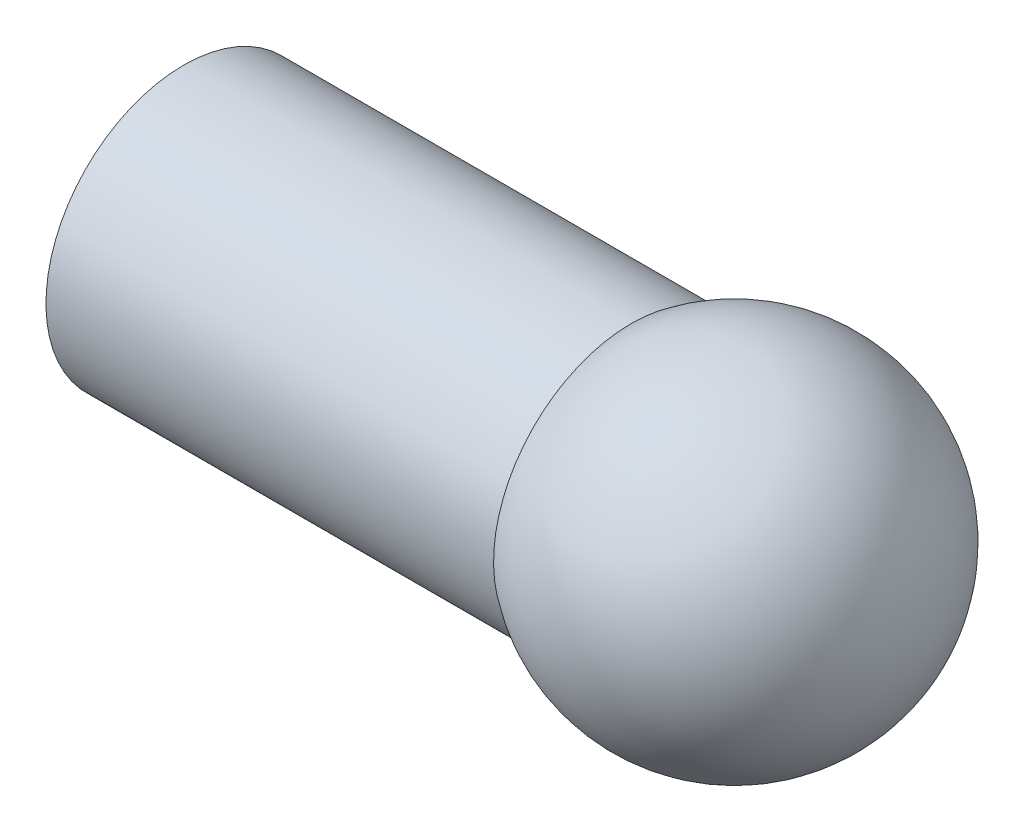
ISO-10303-21;
HEADER;
FILE_DESCRIPTION(('STEP AP214'),'2;1');
FILE_NAME('part.step','',(''),(''),'','','');
FILE_SCHEMA(('AUTOMOTIVE_DESIGN { 1 0 10303 214 1 1 1 1 }'));
ENDSEC;
DATA;
#1=APPLICATION_CONTEXT('core data for automotive mechanical design processes');
#2=APPLICATION_PROTOCOL_DEFINITION('international standard','automotive_design',2000,#1);
#3=PRODUCT_CONTEXT('',#1,'mechanical');
#4=PRODUCT('Part','Part','',(#3));
#5=PRODUCT_RELATED_PRODUCT_CATEGORY('part','',(#4));
#6=PRODUCT_DEFINITION_FORMATION('','',#4);
#7=PRODUCT_DEFINITION_CONTEXT('part definition',#1,'design');
#8=PRODUCT_DEFINITION('design','',#6,#7);
#9=PRODUCT_DEFINITION_SHAPE('','',#8);
#10=(LENGTH_UNIT() NAMED_UNIT(*) SI_UNIT(.MILLI.,.METRE.));
#11=(NAMED_UNIT(*) PLANE_ANGLE_UNIT() SI_UNIT($,.RADIAN.));
#12=(NAMED_UNIT(*) SI_UNIT($,.STERADIAN.) SOLID_ANGLE_UNIT());
#13=UNCERTAINTY_MEASURE_WITH_UNIT(LENGTH_MEASURE(1.E-05),#10,'distance_accuracy_value','');
#14=(GEOMETRIC_REPRESENTATION_CONTEXT(3) GLOBAL_UNCERTAINTY_ASSIGNED_CONTEXT((#13)) GLOBAL_UNIT_ASSIGNED_CONTEXT((#10,
#11,#12)) REPRESENTATION_CONTEXT('',''));
#15=CARTESIAN_POINT('',(0.,0.,0.));
#16=DIRECTION('',(0.,0.,1.));
#17=DIRECTION('',(1.,0.,0.));
#18=AXIS2_PLACEMENT_3D('',#15,#16,#17);
#19=CARTESIAN_POINT('',(31.,0.,35.));
#20=DIRECTION('',(0.,0.,1.));
#21=DIRECTION('',(0.,1.,0.));
#22=AXIS2_PLACEMENT_3D('',#19,#20,#21);
#23=SPHERICAL_SURFACE('',#22,2.5);
#24=CARTESIAN_POINT('',(31.,0.,35.));
#25=DIRECTION('',(1.,0.,0.));
#26=DIRECTION('',(0.,1.,0.));
#27=AXIS2_PLACEMENT_3D('',#24,#25,#26);
#28=SPHERICAL_SURFACE('',#27,2.5);
#29=CARTESIAN_POINT('',(29.5,0.,35.));
#30=DIRECTION('',(1.,0.,0.));
#31=DIRECTION('',(0.,1.,0.));
#32=AXIS2_PLACEMENT_3D('',#29,#30,#31);
#33=CIRCLE('',#32,2.);
#34=CARTESIAN_POINT('',(29.5,2.,35.));
#35=VERTEX_POINT('',#34);
#36=EDGE_CURVE('E43',#35,#35,#33,.F.);
#37=ORIENTED_EDGE('',*,*,#36,.F.);
#38=EDGE_LOOP('',(#37));
#39=FACE_BOUND('',#38,.T.);
#40=ADVANCED_FACE('F39',(#39),#28,.T.);
#41=CARTESIAN_POINT('',(36.6568542494924,0.,35.));
#42=DIRECTION('',(-1.,0.,0.));
#43=DIRECTION('',(0.,-1.,0.));
#44=AXIS2_PLACEMENT_3D('',#41,#42,#43);
#45=CYLINDRICAL_SURFACE('',#44,2.);
#46=ORIENTED_EDGE('',*,*,#36,.T.);
#47=EDGE_LOOP('',(#46));
#48=FACE_BOUND('',#47,.T.);
#49=CARTESIAN_POINT('',(23.,0.,35.));
#50=DIRECTION('',(1.,0.,0.));
#51=DIRECTION('',(0.,1.,0.));
#52=AXIS2_PLACEMENT_3D('',#49,#50,#51);
#53=CIRCLE('',#52,2.);
#54=CARTESIAN_POINT('',(23.,2.,35.));
#55=VERTEX_POINT('',#54);
#56=EDGE_CURVE('E10',#55,#55,#53,.F.);
#57=ORIENTED_EDGE('',*,*,#56,.F.);
#58=EDGE_LOOP('',(#57));
#59=FACE_BOUND('',#58,.T.);
#60=ADVANCED_FACE('F41',(#48,#59),#45,.T.);
#61=CARTESIAN_POINT('',(23.,0.,35.));
#62=DIRECTION('',(1.,0.,0.));
#63=DIRECTION('',(0.,1.,0.));
#64=AXIS2_PLACEMENT_3D('',#61,#62,#63);
#65=PLANE('',#64);
#66=ORIENTED_EDGE('',*,*,#56,.T.);
#67=EDGE_LOOP('',(#66));
#68=FACE_BOUND('',#67,.T.);
#69=ADVANCED_FACE('F60',(#68),#65,.F.);
#70=CLOSED_SHELL('',(#40,#60,#69));
#71=MANIFOLD_SOLID_BREP('B2',#70);
#72=ADVANCED_BREP_SHAPE_REPRESENTATION('',(#18,#71),#14);
#73=SHAPE_DEFINITION_REPRESENTATION(#9,#72);
ENDSEC;
END-ISO-10303-21;
